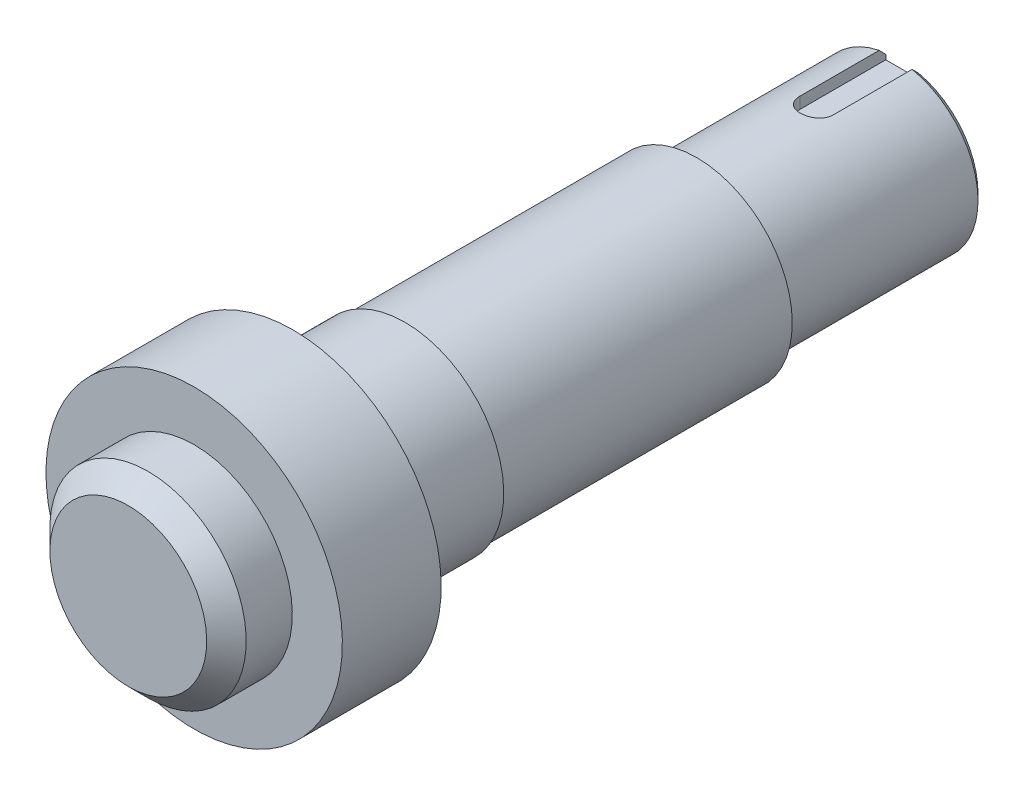
ISO-10303-21;
HEADER;
FILE_DESCRIPTION(('STEP AP214'),'2;1');
FILE_NAME('part.step','',(''),(''),'','','');
FILE_SCHEMA(('AUTOMOTIVE_DESIGN { 1 0 10303 214 1 1 1 1 }'));
ENDSEC;
DATA;
#1=APPLICATION_CONTEXT('core data for automotive mechanical design processes');
#2=APPLICATION_PROTOCOL_DEFINITION('international standard','automotive_design',2000,#1);
#3=PRODUCT_CONTEXT('',#1,'mechanical');
#4=PRODUCT('Part','Part','',(#3));
#5=PRODUCT_RELATED_PRODUCT_CATEGORY('part','',(#4));
#6=PRODUCT_DEFINITION_FORMATION('','',#4);
#7=PRODUCT_DEFINITION_CONTEXT('part definition',#1,'design');
#8=PRODUCT_DEFINITION('design','',#6,#7);
#9=PRODUCT_DEFINITION_SHAPE('','',#8);
#10=(LENGTH_UNIT() NAMED_UNIT(*) SI_UNIT(.MILLI.,.METRE.));
#11=(NAMED_UNIT(*) PLANE_ANGLE_UNIT() SI_UNIT($,.RADIAN.));
#12=(NAMED_UNIT(*) SI_UNIT($,.STERADIAN.) SOLID_ANGLE_UNIT());
#13=UNCERTAINTY_MEASURE_WITH_UNIT(LENGTH_MEASURE(1.E-05),#10,'distance_accuracy_value','');
#14=(GEOMETRIC_REPRESENTATION_CONTEXT(3) GLOBAL_UNCERTAINTY_ASSIGNED_CONTEXT((#13)) GLOBAL_UNIT_ASSIGNED_CONTEXT((#10,
#11,#12)) REPRESENTATION_CONTEXT('',''));
#15=CARTESIAN_POINT('',(0.,0.,0.));
#16=DIRECTION('',(0.,0.,1.));
#17=DIRECTION('',(1.,0.,0.));
#18=AXIS2_PLACEMENT_3D('',#15,#16,#17);
#19=CARTESIAN_POINT('',(-777.275503865214,232.762545949071,963.610325914296));
#20=DIRECTION('',(0.,0.,1.));
#21=DIRECTION('',(0.,1.,0.));
#22=AXIS2_PLACEMENT_3D('',#19,#20,#21);
#23=CYLINDRICAL_SURFACE('',#22,12.5);
#24=CARTESIAN_POINT('',(-777.275503865214,232.762545949071,877.310325914296));
#25=DIRECTION('',(0.,0.,1.));
#26=DIRECTION('',(0.,1.,0.));
#27=AXIS2_PLACEMENT_3D('',#24,#25,#26);
#28=CIRCLE('',#27,12.5);
#29=CARTESIAN_POINT('',(-777.275503865214,245.262545949071,877.310325914296));
#30=VERTEX_POINT('',#29);
#31=EDGE_CURVE('E115',#30,#30,#28,.T.);
#32=ORIENTED_EDGE('',*,*,#31,.F.);
#33=EDGE_LOOP('',(#32));
#34=FACE_BOUND('',#33,.T.);
#35=DIRECTION('',(0.,0.,1.));
#36=VECTOR('',#35,1.);
#37=CARTESIAN_POINT('',(-779.775503865214,245.009994662987,963.610325914296));
#38=LINE('',#37,#36);
#39=CARTESIAN_POINT('',(-779.775503865214,245.009994662987,847.110325914296));
#40=VERTEX_POINT('',#39);
#41=CARTESIAN_POINT('',(-779.775503865214,245.009994662987,859.110325914296));
#42=VERTEX_POINT('',#41);
#43=EDGE_CURVE('E90',#40,#42,#38,.T.);
#44=ORIENTED_EDGE('',*,*,#43,.F.);
#45=CARTESIAN_POINT('',(-777.275503865214,232.762545949071,847.110325914296));
#46=DIRECTION('',(0.,0.,1.));
#47=DIRECTION('',(0.,1.,0.));
#48=AXIS2_PLACEMENT_3D('',#45,#46,#47);
#49=CIRCLE('',#48,12.5);
#50=CARTESIAN_POINT('',(-774.775503865214,245.009994662987,847.110325914296));
#51=VERTEX_POINT('',#50);
#52=EDGE_CURVE('E157',#40,#51,#49,.T.);
#53=ORIENTED_EDGE('',*,*,#52,.T.);
#54=DIRECTION('',(0.,0.,1.));
#55=VECTOR('',#54,1.);
#56=CARTESIAN_POINT('',(-774.775503865214,245.009994662987,963.610325914296));
#57=LINE('',#56,#55);
#58=CARTESIAN_POINT('',(-774.775503865214,245.009994662987,859.110325914295));
#59=VERTEX_POINT('',#58);
#60=EDGE_CURVE('E94',#59,#51,#57,.F.);
#61=ORIENTED_EDGE('',*,*,#60,.F.);
#62=CARTESIAN_POINT('',(-779.775503865214,245.009994662987,859.110325914296));
#63=CARTESIAN_POINT('',(-779.775511417941,245.009988636119,859.179889921444));
#64=CARTESIAN_POINT('',(-779.772600460745,245.010587203752,859.24944975618));
#65=CARTESIAN_POINT('',(-779.761000110563,245.012948901932,859.38805766427));
#66=CARTESIAN_POINT('',(-779.752311432402,245.014711888417,859.457105799863));
#67=CARTESIAN_POINT('',(-779.729231750036,245.019354288111,859.594100160948));
#68=CARTESIAN_POINT('',(-779.714849432765,245.022232000412,859.662047901709));
#69=CARTESIAN_POINT('',(-779.680509878285,245.029014463124,859.796447924882));
#70=CARTESIAN_POINT('',(-779.660552618317,245.032919217728,859.862900201187));
#71=CARTESIAN_POINT('',(-779.592516598148,245.046015199514,860.059330668975));
#72=CARTESIAN_POINT('',(-779.536255182271,245.056592085419,860.186490962593));
#73=CARTESIAN_POINT('',(-779.403633574547,245.080239355672,860.429515399917));
#74=CARTESIAN_POINT('',(-779.327271299583,245.093309998418,860.54537837114));
#75=CARTESIAN_POINT('',(-779.1554566536,245.120677719595,860.764218062592));
#76=CARTESIAN_POINT('',(-779.059776525862,245.134988141767,860.867014624698));
#77=CARTESIAN_POINT('',(-778.852529936537,245.163106618936,861.055214007994));
#78=CARTESIAN_POINT('',(-778.740961018056,245.176914595825,861.140614134188));
#79=CARTESIAN_POINT('',(-778.503904108928,245.202616201751,861.292297625117));
#80=CARTESIAN_POINT('',(-778.378303456668,245.214492128976,861.35840819231));
#81=CARTESIAN_POINT('',(-778.117506840974,245.234839837578,861.468515770665));
#82=CARTESIAN_POINT('',(-777.982312300228,245.243312122447,861.512516052796));
#83=CARTESIAN_POINT('',(-777.708047395187,245.255803892932,861.576593497365));
#84=CARTESIAN_POINT('',(-777.569051453731,245.259880511958,861.596977877801));
#85=CARTESIAN_POINT('',(-777.28955355501,245.263318992875,861.614203373095));
#86=CARTESIAN_POINT('',(-777.149051708682,245.262681199712,861.611046210458));
#87=CARTESIAN_POINT('',(-776.872648358867,245.256806810127,861.581510410689));
#88=CARTESIAN_POINT('',(-776.736709831967,245.251635869853,861.555463288816));
#89=CARTESIAN_POINT('',(-776.471173848683,245.237350311625,861.481412972573));
#90=CARTESIAN_POINT('',(-776.341576599822,245.228235564704,861.433409060183));
#91=CARTESIAN_POINT('',(-776.091453186971,245.206978177081,861.316499905363));
#92=CARTESIAN_POINT('',(-775.970989548183,245.194816758847,861.247464446928));
#93=CARTESIAN_POINT('',(-775.743237770496,245.168807239801,861.090550238656));
#94=CARTESIAN_POINT('',(-775.635950724661,245.154958999247,861.0026699272));
#95=CARTESIAN_POINT('',(-775.435638348871,245.126821883283,860.808755010218));
#96=CARTESIAN_POINT('',(-775.342892127725,245.112529530114,860.702432409113));
#97=CARTESIAN_POINT('',(-775.176476615465,245.085338601982,860.475564018077));
#98=CARTESIAN_POINT('',(-775.10281260916,245.072440413706,860.355014301381));
#99=CARTESIAN_POINT('',(-774.976553978602,245.049489200129,860.10269490193));
#100=CARTESIAN_POINT('',(-774.924016673628,245.039443936529,859.970895855804));
#101=CARTESIAN_POINT('',(-774.841986121889,245.023449975633,859.700179336156));
#102=CARTESIAN_POINT('',(-774.812458546503,245.017495177278,859.561272797675));
#103=CARTESIAN_POINT('',(-774.788421519909,245.01262537887,859.369433872179));
#104=CARTESIAN_POINT('',(-774.783575726075,245.011639945871,859.317690564839));
#105=CARTESIAN_POINT('',(-774.777120953552,245.01032513374,859.214081253952));
#106=CARTESIAN_POINT('',(-774.775506557952,245.009994656691,859.162215601906));
#107=CARTESIAN_POINT('',(-774.775503865214,245.009994662987,859.110325914295));
#108=B_SPLINE_CURVE_WITH_KNOTS('',3,(#62,#63,#64,#65,#66,#67,#68,#69,#70,#71,#72,#73,#74,#75,
#76,#77,#78,#79,#80,#81,#82,#83,#84,#85,#86,#87,#88,#89,#90,#91,#92,#93,#94,#95,#96,#97,#98,#99,
#100,#101,#102,#103,#104,#105,#106,#107),.UNSPECIFIED.,.F.,.F.,(4,2,2,2,2,2,2,2,2,2,2,2,2,2,2,2,
2,2,2,2,2,2,4),(0.,0.208621275894876,0.417216745803808,0.625495175237058,0.83377445493101,
1.25000691135215,1.66628252025777,2.08778731527753,2.50935735880438,2.93459542557453,
3.35977056463051,3.77935021287083,4.19889916132029,4.61247011057773,5.02605458519848,
5.44225366753909,5.85848725240702,6.28192795775074,6.70548580970528,7.1301851948687,
7.55424974394832,7.71010621722891,7.86570120305823),.UNSPECIFIED.);
#109=EDGE_CURVE('E150',#42,#59,#108,.T.);
#110=ORIENTED_EDGE('',*,*,#109,.F.);
#111=EDGE_LOOP('',(#44,#53,#61,#110));
#112=FACE_BOUND('',#111,.T.);
#113=ADVANCED_FACE('F34',(#34,#112),#23,.T.);
#114=CARTESIAN_POINT('',(-789.775503865214,232.762545949071,846.110325914295));
#115=DIRECTION('',(0.,0.,1.));
#116=DIRECTION('',(0.,1.,0.));
#117=AXIS2_PLACEMENT_3D('',#114,#115,#116);
#118=PLANE('',#117);
#119=DIRECTION('',(0.,-1.,0.));
#120=VECTOR('',#119,1.);
#121=CARTESIAN_POINT('',(-774.775503865214,232.762545949071,846.110325914295));
#122=LINE('',#121,#120);
#123=CARTESIAN_POINT('',(-774.775503865214,243.987518109393,846.110325914295));
#124=VERTEX_POINT('',#123);
#125=CARTESIAN_POINT('',(-774.775503865214,243.262545949071,846.110325914295));
#126=VERTEX_POINT('',#125);
#127=EDGE_CURVE('E146',#124,#126,#122,.T.);
#128=ORIENTED_EDGE('',*,*,#127,.F.);
#129=CARTESIAN_POINT('',(-777.275503865214,232.762545949071,846.110325914295));
#130=DIRECTION('',(0.,0.,1.));
#131=DIRECTION('',(0.,1.,0.));
#132=AXIS2_PLACEMENT_3D('',#129,#130,#131);
#133=CIRCLE('',#132,11.5);
#134=CARTESIAN_POINT('',(-779.775503865214,243.987518109393,846.110325914295));
#135=VERTEX_POINT('',#134);
#136=EDGE_CURVE('E47',#124,#135,#133,.F.);
#137=ORIENTED_EDGE('',*,*,#136,.T.);
#138=DIRECTION('',(0.,1.,0.));
#139=VECTOR('',#138,1.);
#140=CARTESIAN_POINT('',(-779.775503865214,232.762545949071,846.110325914295));
#141=LINE('',#140,#139);
#142=CARTESIAN_POINT('',(-779.775503865214,243.262545949071,846.110325914295));
#143=VERTEX_POINT('',#142);
#144=EDGE_CURVE('E148',#143,#135,#141,.T.);
#145=ORIENTED_EDGE('',*,*,#144,.F.);
#146=DIRECTION('',(-1.,0.,0.));
#147=VECTOR('',#146,1.);
#148=CARTESIAN_POINT('',(-789.775503865214,243.262545949071,846.110325914295));
#149=LINE('',#148,#147);
#150=EDGE_CURVE('E104',#126,#143,#149,.T.);
#151=ORIENTED_EDGE('',*,*,#150,.F.);
#152=EDGE_LOOP('',(#128,#137,#145,#151));
#153=FACE_BOUND('',#152,.T.);
#154=ADVANCED_FACE('F171',(#153),#118,.F.);
#155=CARTESIAN_POINT('',(-777.275503865214,232.762545949071,963.610325914296));
#156=DIRECTION('',(0.,0.,-1.));
#157=DIRECTION('',(0.,-1.,0.));
#158=AXIS2_PLACEMENT_3D('',#155,#156,#157);
#159=PLANE('',#158);
#160=CARTESIAN_POINT('',(-777.275503865214,232.762545949071,963.610325914296));
#161=DIRECTION('',(0.,0.,-1.));
#162=DIRECTION('',(0.,-1.,0.));
#163=AXIS2_PLACEMENT_3D('',#160,#161,#162);
#164=CIRCLE('',#163,11.9);
#165=CARTESIAN_POINT('',(-777.275503865214,220.862545949071,963.610325914296));
#166=VERTEX_POINT('',#165);
#167=EDGE_CURVE('E139',#166,#166,#164,.F.);
#168=ORIENTED_EDGE('',*,*,#167,.T.);
#169=EDGE_LOOP('',(#168));
#170=FACE_BOUND('',#169,.T.);
#171=ADVANCED_FACE('F173',(#170),#159,.F.);
#172=CARTESIAN_POINT('',(-777.275503865214,232.762545949071,963.610325914296));
#173=DIRECTION('',(0.,0.,1.));
#174=DIRECTION('',(0.,1.,0.));
#175=AXIS2_PLACEMENT_3D('',#172,#173,#174);
#176=CYLINDRICAL_SURFACE('',#175,14.9);
#177=CARTESIAN_POINT('',(-777.275503865214,232.762545949071,960.610325914296));
#178=DIRECTION('',(0.,0.,-1.));
#179=DIRECTION('',(0.,-1.,0.));
#180=AXIS2_PLACEMENT_3D('',#177,#178,#179);
#181=CIRCLE('',#180,14.9);
#182=CARTESIAN_POINT('',(-777.275503865214,217.862545949071,960.610325914296));
#183=VERTEX_POINT('',#182);
#184=EDGE_CURVE('E142',#183,#183,#181,.T.);
#185=ORIENTED_EDGE('',*,*,#184,.T.);
#186=EDGE_LOOP('',(#185));
#187=FACE_BOUND('',#186,.T.);
#188=CARTESIAN_POINT('',(-777.275503865214,232.762545949071,953.610325914295));
#189=DIRECTION('',(0.,0.,1.));
#190=DIRECTION('',(0.,1.,0.));
#191=AXIS2_PLACEMENT_3D('',#188,#189,#190);
#192=CIRCLE('',#191,14.9);
#193=CARTESIAN_POINT('',(-777.275503865214,247.662545949071,953.610325914295));
#194=VERTEX_POINT('',#193);
#195=EDGE_CURVE('E136',#194,#194,#192,.T.);
#196=ORIENTED_EDGE('',*,*,#195,.T.);
#197=EDGE_LOOP('',(#196));
#198=FACE_BOUND('',#197,.T.);
#199=ADVANCED_FACE('F178',(#187,#198),#176,.T.);
#200=CARTESIAN_POINT('',(-792.175503865214,232.762545949071,953.610325914295));
#201=DIRECTION('',(0.,0.,-1.));
#202=DIRECTION('',(0.,-1.,0.));
#203=AXIS2_PLACEMENT_3D('',#200,#201,#202);
#204=PLANE('',#203);
#205=ORIENTED_EDGE('',*,*,#195,.F.);
#206=EDGE_LOOP('',(#205));
#207=FACE_BOUND('',#206,.T.);
#208=CARTESIAN_POINT('',(-777.275503865214,232.762545949071,953.610325914295));
#209=DIRECTION('',(0.,0.,1.));
#210=DIRECTION('',(0.,1.,0.));
#211=AXIS2_PLACEMENT_3D('',#208,#209,#210);
#212=CIRCLE('',#211,22.5);
#213=CARTESIAN_POINT('',(-777.275503865214,255.262545949071,953.610325914295));
#214=VERTEX_POINT('',#213);
#215=EDGE_CURVE('E133',#214,#214,#212,.T.);
#216=ORIENTED_EDGE('',*,*,#215,.T.);
#217=EDGE_LOOP('',(#216));
#218=FACE_BOUND('',#217,.T.);
#219=ADVANCED_FACE('F290',(#207,#218),#204,.F.);
#220=CARTESIAN_POINT('',(-777.275503865214,232.762545949071,963.610325914296));
#221=DIRECTION('',(0.,0.,1.));
#222=DIRECTION('',(0.,1.,0.));
#223=AXIS2_PLACEMENT_3D('',#220,#221,#222);
#224=CYLINDRICAL_SURFACE('',#223,22.5);
#225=ORIENTED_EDGE('',*,*,#215,.F.);
#226=EDGE_LOOP('',(#225));
#227=FACE_BOUND('',#226,.T.);
#228=CARTESIAN_POINT('',(-777.275503865214,232.762545949071,938.610325914295));
#229=DIRECTION('',(0.,0.,1.));
#230=DIRECTION('',(0.,1.,0.));
#231=AXIS2_PLACEMENT_3D('',#228,#229,#230);
#232=CIRCLE('',#231,22.5);
#233=CARTESIAN_POINT('',(-777.275503865214,255.262545949071,938.610325914295));
#234=VERTEX_POINT('',#233);
#235=EDGE_CURVE('E130',#234,#234,#232,.T.);
#236=ORIENTED_EDGE('',*,*,#235,.T.);
#237=EDGE_LOOP('',(#236));
#238=FACE_BOUND('',#237,.T.);
#239=ADVANCED_FACE('F280',(#227,#238),#224,.T.);
#240=CARTESIAN_POINT('',(-799.775503865214,232.762545949071,938.610325914295));
#241=DIRECTION('',(0.,0.,1.));
#242=DIRECTION('',(0.,1.,0.));
#243=AXIS2_PLACEMENT_3D('',#240,#241,#242);
#244=PLANE('',#243);
#245=ORIENTED_EDGE('',*,*,#235,.F.);
#246=EDGE_LOOP('',(#245));
#247=FACE_BOUND('',#246,.T.);
#248=CARTESIAN_POINT('',(-777.275503865214,232.762545949071,938.610325914295));
#249=DIRECTION('',(0.,0.,1.));
#250=DIRECTION('',(0.,1.,0.));
#251=AXIS2_PLACEMENT_3D('',#248,#249,#250);
#252=CIRCLE('',#251,15.);
#253=CARTESIAN_POINT('',(-777.275503865214,247.762545949071,938.610325914295));
#254=VERTEX_POINT('',#253);
#255=EDGE_CURVE('E127',#254,#254,#252,.T.);
#256=ORIENTED_EDGE('',*,*,#255,.T.);
#257=EDGE_LOOP('',(#256));
#258=FACE_BOUND('',#257,.T.);
#259=ADVANCED_FACE('F270',(#247,#258),#244,.F.);
#260=CARTESIAN_POINT('',(-777.275503865214,232.762545949071,963.610325914296));
#261=DIRECTION('',(0.,0.,1.));
#262=DIRECTION('',(0.,1.,0.));
#263=AXIS2_PLACEMENT_3D('',#260,#261,#262);
#264=CYLINDRICAL_SURFACE('',#263,15.);
#265=ORIENTED_EDGE('',*,*,#255,.F.);
#266=EDGE_LOOP('',(#265));
#267=FACE_BOUND('',#266,.T.);
#268=CARTESIAN_POINT('',(-777.275503865214,232.762545949071,921.610325914295));
#269=DIRECTION('',(0.,0.,1.));
#270=DIRECTION('',(0.,1.,0.));
#271=AXIS2_PLACEMENT_3D('',#268,#269,#270);
#272=CIRCLE('',#271,15.);
#273=CARTESIAN_POINT('',(-777.275503865214,247.762545949071,921.610325914295));
#274=VERTEX_POINT('',#273);
#275=EDGE_CURVE('E124',#274,#274,#272,.T.);
#276=ORIENTED_EDGE('',*,*,#275,.T.);
#277=EDGE_LOOP('',(#276));
#278=FACE_BOUND('',#277,.T.);
#279=ADVANCED_FACE('F260',(#267,#278),#264,.T.);
#280=CARTESIAN_POINT('',(-792.275503865214,232.762545949071,921.610325914295));
#281=DIRECTION('',(0.,0.,1.));
#282=DIRECTION('',(0.,1.,0.));
#283=AXIS2_PLACEMENT_3D('',#280,#281,#282);
#284=PLANE('',#283);
#285=ORIENTED_EDGE('',*,*,#275,.F.);
#286=EDGE_LOOP('',(#285));
#287=FACE_BOUND('',#286,.T.);
#288=CARTESIAN_POINT('',(-777.275503865214,232.762545949071,921.610325914295));
#289=DIRECTION('',(0.,0.,1.));
#290=DIRECTION('',(0.,1.,0.));
#291=AXIS2_PLACEMENT_3D('',#288,#289,#290);
#292=CIRCLE('',#291,14.5);
#293=CARTESIAN_POINT('',(-777.275503865214,247.262545949071,921.610325914295));
#294=VERTEX_POINT('',#293);
#295=EDGE_CURVE('E121',#294,#294,#292,.T.);
#296=ORIENTED_EDGE('',*,*,#295,.T.);
#297=EDGE_LOOP('',(#296));
#298=FACE_BOUND('',#297,.T.);
#299=ADVANCED_FACE('F250',(#287,#298),#284,.F.);
#300=CARTESIAN_POINT('',(-777.275503865214,232.762545949071,963.610325914296));
#301=DIRECTION('',(0.,0.,1.));
#302=DIRECTION('',(0.,1.,0.));
#303=AXIS2_PLACEMENT_3D('',#300,#301,#302);
#304=CYLINDRICAL_SURFACE('',#303,14.5);
#305=ORIENTED_EDGE('',*,*,#295,.F.);
#306=EDGE_LOOP('',(#305));
#307=FACE_BOUND('',#306,.T.);
#308=CARTESIAN_POINT('',(-777.275503865214,232.762545949071,877.310325914296));
#309=DIRECTION('',(0.,0.,1.));
#310=DIRECTION('',(0.,1.,0.));
#311=AXIS2_PLACEMENT_3D('',#308,#309,#310);
#312=CIRCLE('',#311,14.5);
#313=CARTESIAN_POINT('',(-777.275503865214,247.262545949071,877.310325914296));
#314=VERTEX_POINT('',#313);
#315=EDGE_CURVE('E118',#314,#314,#312,.T.);
#316=ORIENTED_EDGE('',*,*,#315,.T.);
#317=EDGE_LOOP('',(#316));
#318=FACE_BOUND('',#317,.T.);
#319=ADVANCED_FACE('F241',(#307,#318),#304,.T.);
#320=CARTESIAN_POINT('',(-791.775503865214,232.762545949071,877.310325914296));
#321=DIRECTION('',(0.,0.,1.));
#322=DIRECTION('',(0.,1.,0.));
#323=AXIS2_PLACEMENT_3D('',#320,#321,#322);
#324=PLANE('',#323);
#325=ORIENTED_EDGE('',*,*,#315,.F.);
#326=EDGE_LOOP('',(#325));
#327=FACE_BOUND('',#326,.T.);
#328=ORIENTED_EDGE('',*,*,#31,.T.);
#329=EDGE_LOOP('',(#328));
#330=FACE_BOUND('',#329,.T.);
#331=ADVANCED_FACE('F232',(#327,#330),#324,.F.);
#332=CARTESIAN_POINT('',(-777.275503865214,232.762545949071,963.610325914296));
#333=DIRECTION('',(0.,0.,-1.));
#334=DIRECTION('',(0.,-1.,0.));
#335=AXIS2_PLACEMENT_3D('',#332,#333,#334);
#336=CONICAL_SURFACE('',#335,11.9,0.785398163397444);
#337=ORIENTED_EDGE('',*,*,#184,.F.);
#338=EDGE_LOOP('',(#337));
#339=FACE_BOUND('',#338,.T.);
#340=ORIENTED_EDGE('',*,*,#167,.F.);
#341=EDGE_LOOP('',(#340));
#342=FACE_BOUND('',#341,.T.);
#343=ADVANCED_FACE('F165',(#339,#342),#336,.T.);
#344=CARTESIAN_POINT('',(-777.275503865214,255.262545949071,859.110325914295));
#345=DIRECTION('',(0.,-1.,0.));
#346=DIRECTION('',(0.,0.,1.));
#347=AXIS2_PLACEMENT_3D('',#344,#345,#346);
#348=CYLINDRICAL_SURFACE('',#347,2.5);
#349=ORIENTED_EDGE('',*,*,#109,.T.);
#350=DIRECTION('',(0.,-1.,0.));
#351=VECTOR('',#350,1.);
#352=CARTESIAN_POINT('',(-774.775503865214,255.262545949071,859.110325914295));
#353=LINE('',#352,#351);
#354=CARTESIAN_POINT('',(-774.775503865214,243.262545949071,859.110325914295));
#355=VERTEX_POINT('',#354);
#356=EDGE_CURVE('E95',#59,#355,#353,.T.);
#357=ORIENTED_EDGE('',*,*,#356,.T.);
#358=CARTESIAN_POINT('',(-777.275503865214,243.262545949071,859.110325914295));
#359=DIRECTION('',(0.,1.,0.));
#360=DIRECTION('',(0.,0.,-1.));
#361=AXIS2_PLACEMENT_3D('',#358,#359,#360);
#362=CIRCLE('',#361,2.5);
#363=CARTESIAN_POINT('',(-779.775503865214,243.262545949071,859.110325914296));
#364=VERTEX_POINT('',#363);
#365=EDGE_CURVE('E101',#364,#355,#362,.T.);
#366=ORIENTED_EDGE('',*,*,#365,.F.);
#367=DIRECTION('',(0.,-1.,0.));
#368=VECTOR('',#367,1.);
#369=CARTESIAN_POINT('',(-779.775503865214,255.262545949071,859.110325914296));
#370=LINE('',#369,#368);
#371=EDGE_CURVE('E85',#42,#364,#370,.T.);
#372=ORIENTED_EDGE('',*,*,#371,.F.);
#373=EDGE_LOOP('',(#349,#357,#366,#372));
#374=FACE_BOUND('',#373,.T.);
#375=ADVANCED_FACE('F106',(#374),#348,.F.);
#376=CARTESIAN_POINT('',(-779.775503865214,255.262545949071,833.110325914296));
#377=DIRECTION('',(1.,0.,0.));
#378=DIRECTION('',(0.,-1.,0.));
#379=AXIS2_PLACEMENT_3D('',#376,#377,#378);
#380=PLANE('',#379);
#381=ORIENTED_EDGE('',*,*,#144,.T.);
#382=CARTESIAN_POINT('',(-779.775503865214,243.987518109393,846.110325914295));
#383=CARTESIAN_POINT('',(-779.775503865214,244.158088672331,846.276831233249));
#384=CARTESIAN_POINT('',(-779.775503865214,244.328580334062,846.443417226839));
#385=CARTESIAN_POINT('',(-779.775503865214,244.669405851923,846.776750560175));
#386=CARTESIAN_POINT('',(-779.775503865214,244.839739708058,846.943497899919));
#387=CARTESIAN_POINT('',(-779.775503865214,245.009994662987,847.110325914296));
#388=B_SPLINE_CURVE_WITH_KNOTS('',3,(#382,#383,#384,#385,#386,#387),.UNSPECIFIED.,.F.,.F.,(4,2,
4),(0.,0.715097685506974,1.43019535765802),.UNSPECIFIED.);
#389=EDGE_CURVE('E11',#135,#40,#388,.T.);
#390=ORIENTED_EDGE('',*,*,#389,.T.);
#391=ORIENTED_EDGE('',*,*,#43,.T.);
#392=ORIENTED_EDGE('',*,*,#371,.T.);
#393=DIRECTION('',(0.,0.,1.));
#394=VECTOR('',#393,1.);
#395=CARTESIAN_POINT('',(-779.775503865214,243.262545949071,833.110325914296));
#396=LINE('',#395,#394);
#397=EDGE_CURVE('E88',#143,#364,#396,.T.);
#398=ORIENTED_EDGE('',*,*,#397,.F.);
#399=EDGE_LOOP('',(#381,#390,#391,#392,#398));
#400=FACE_BOUND('',#399,.T.);
#401=ADVANCED_FACE('F87',(#400),#380,.T.);
#402=CARTESIAN_POINT('',(-774.775503865214,255.262545949071,833.110325914296));
#403=DIRECTION('',(-1.,0.,0.));
#404=DIRECTION('',(0.,1.,0.));
#405=AXIS2_PLACEMENT_3D('',#402,#403,#404);
#406=PLANE('',#405);
#407=ORIENTED_EDGE('',*,*,#60,.T.);
#408=CARTESIAN_POINT('',(-774.775503865214,245.009994662987,847.110325914296));
#409=CARTESIAN_POINT('',(-774.775503865214,244.839739708058,846.943497899919));
#410=CARTESIAN_POINT('',(-774.775503865214,244.669405851924,846.776750560175));
#411=CARTESIAN_POINT('',(-774.775503865214,244.328580334062,846.443417226839));
#412=CARTESIAN_POINT('',(-774.775503865214,244.158088672331,846.276831233249));
#413=CARTESIAN_POINT('',(-774.775503865214,243.987518109393,846.110325914296));
#414=B_SPLINE_CURVE_WITH_KNOTS('',3,(#408,#409,#410,#411,#412,#413),.UNSPECIFIED.,.F.,.F.,(4,2,
4),(0.,0.715097672151004,1.43019535765792),.UNSPECIFIED.);
#415=EDGE_CURVE('E61',#51,#124,#414,.T.);
#416=ORIENTED_EDGE('',*,*,#415,.T.);
#417=ORIENTED_EDGE('',*,*,#127,.T.);
#418=DIRECTION('',(0.,0.,-1.));
#419=VECTOR('',#418,1.);
#420=CARTESIAN_POINT('',(-774.775503865214,243.262545949071,833.110325914296));
#421=LINE('',#420,#419);
#422=EDGE_CURVE('E108',#355,#126,#421,.T.);
#423=ORIENTED_EDGE('',*,*,#422,.F.);
#424=ORIENTED_EDGE('',*,*,#356,.F.);
#425=EDGE_LOOP('',(#407,#416,#417,#423,#424));
#426=FACE_BOUND('',#425,.T.);
#427=ADVANCED_FACE('F166',(#426),#406,.T.);
#428=CARTESIAN_POINT('',(-777.275503865214,243.262545949071,833.110325914296));
#429=DIRECTION('',(0.,1.,0.));
#430=DIRECTION('',(0.,0.,-1.));
#431=AXIS2_PLACEMENT_3D('',#428,#429,#430);
#432=PLANE('',#431);
#433=ORIENTED_EDGE('',*,*,#150,.T.);
#434=ORIENTED_EDGE('',*,*,#397,.T.);
#435=ORIENTED_EDGE('',*,*,#365,.T.);
#436=ORIENTED_EDGE('',*,*,#422,.T.);
#437=EDGE_LOOP('',(#433,#434,#435,#436));
#438=FACE_BOUND('',#437,.T.);
#439=ADVANCED_FACE('F99',(#438),#432,.T.);
#440=CARTESIAN_POINT('',(-777.275503865214,232.762545949071,847.110325914296));
#441=DIRECTION('',(0.,0.,1.));
#442=DIRECTION('',(0.,1.,0.));
#443=AXIS2_PLACEMENT_3D('',#440,#441,#442);
#444=CONICAL_SURFACE('',#443,12.5,0.785398163397447);
#445=ORIENTED_EDGE('',*,*,#389,.F.);
#446=ORIENTED_EDGE('',*,*,#136,.F.);
#447=ORIENTED_EDGE('',*,*,#415,.F.);
#448=ORIENTED_EDGE('',*,*,#52,.F.);
#449=EDGE_LOOP('',(#445,#446,#447,#448));
#450=FACE_BOUND('',#449,.T.);
#451=ADVANCED_FACE('F36',(#450),#444,.T.);
#452=CLOSED_SHELL('',(#113,#154,#171,#199,#219,#239,#259,#279,#299,#319,#331,#343,#375,#401,
#427,#439,#451));
#453=MANIFOLD_SOLID_BREP('B2',#452);
#454=ADVANCED_BREP_SHAPE_REPRESENTATION('',(#18,#453),#14);
#455=SHAPE_DEFINITION_REPRESENTATION(#9,#454);
ENDSEC;
END-ISO-10303-21;
